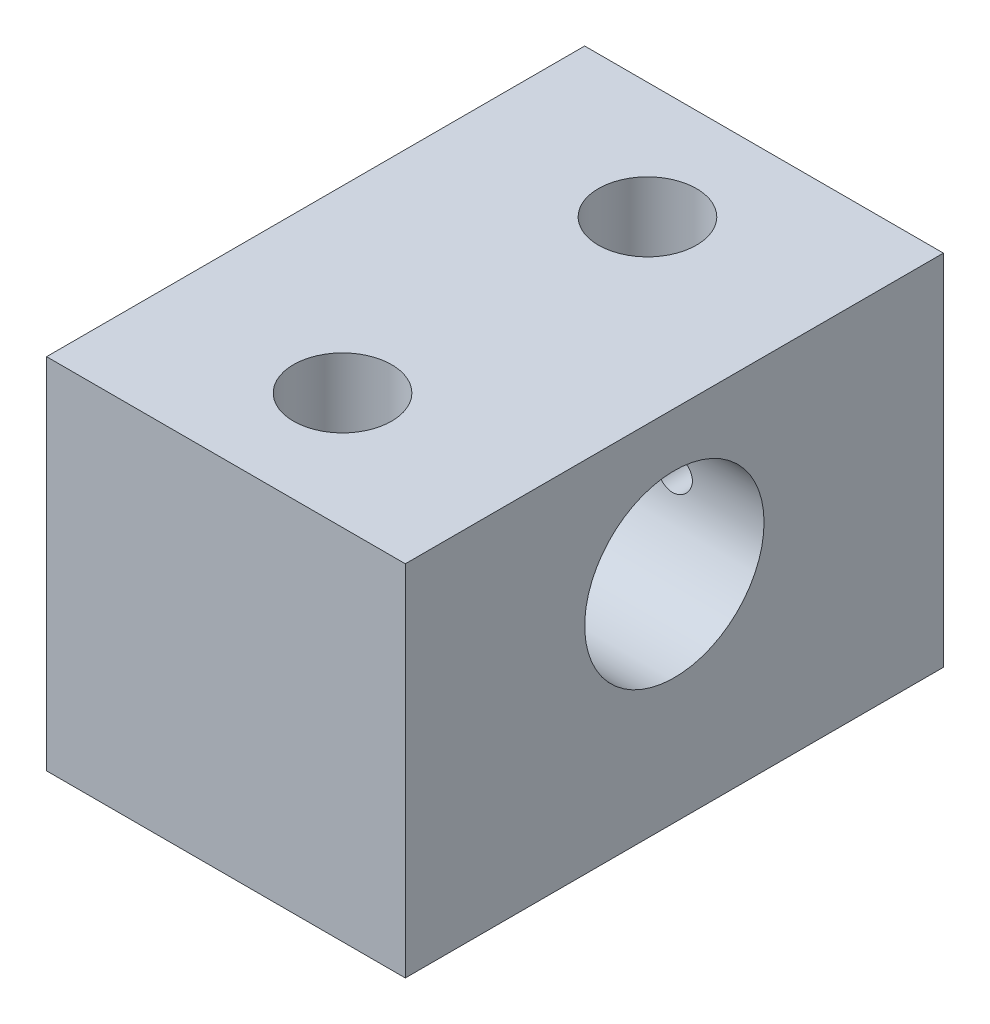
ISO-10303-21;
HEADER;
FILE_DESCRIPTION(('STEP AP214'),'2;1');
FILE_NAME('part.step','',(''),(''),'','','');
FILE_SCHEMA(('AUTOMOTIVE_DESIGN { 1 0 10303 214 1 1 1 1 }'));
ENDSEC;
DATA;
#1=APPLICATION_CONTEXT('core data for automotive mechanical design processes');
#2=APPLICATION_PROTOCOL_DEFINITION('international standard','automotive_design',2000,#1);
#3=PRODUCT_CONTEXT('',#1,'mechanical');
#4=PRODUCT('Part','Part','',(#3));
#5=PRODUCT_RELATED_PRODUCT_CATEGORY('part','',(#4));
#6=PRODUCT_DEFINITION_FORMATION('','',#4);
#7=PRODUCT_DEFINITION_CONTEXT('part definition',#1,'design');
#8=PRODUCT_DEFINITION('design','',#6,#7);
#9=PRODUCT_DEFINITION_SHAPE('','',#8);
#10=(LENGTH_UNIT() NAMED_UNIT(*) SI_UNIT(.MILLI.,.METRE.));
#11=(NAMED_UNIT(*) PLANE_ANGLE_UNIT() SI_UNIT($,.RADIAN.));
#12=(NAMED_UNIT(*) SI_UNIT($,.STERADIAN.) SOLID_ANGLE_UNIT());
#13=UNCERTAINTY_MEASURE_WITH_UNIT(LENGTH_MEASURE(1.E-05),#10,'distance_accuracy_value','');
#14=(GEOMETRIC_REPRESENTATION_CONTEXT(3) GLOBAL_UNCERTAINTY_ASSIGNED_CONTEXT((#13)) GLOBAL_UNIT_ASSIGNED_CONTEXT((#10,
#11,#12)) REPRESENTATION_CONTEXT('',''));
#15=CARTESIAN_POINT('',(0.,0.,0.));
#16=DIRECTION('',(0.,0.,1.));
#17=DIRECTION('',(1.,0.,0.));
#18=AXIS2_PLACEMENT_3D('',#15,#16,#17);
#19=CARTESIAN_POINT('',(25.4,-25.4,38.1));
#20=DIRECTION('',(-1.,0.,0.));
#21=DIRECTION('',(0.,0.,1.));
#22=AXIS2_PLACEMENT_3D('',#19,#20,#21);
#23=PLANE('',#22);
#24=CARTESIAN_POINT('',(25.4,5.08,0.));
#25=DIRECTION('',(1.,0.,0.));
#26=DIRECTION('',(0.,0.,-1.));
#27=AXIS2_PLACEMENT_3D('',#24,#25,#26);
#28=CIRCLE('',#27,12.7);
#29=CARTESIAN_POINT('',(25.4,5.08,-12.7));
#30=VERTEX_POINT('',#29);
#31=EDGE_CURVE('E118',#30,#30,#28,.T.);
#32=ORIENTED_EDGE('',*,*,#31,.F.);
#33=EDGE_LOOP('',(#32));
#34=FACE_BOUND('',#33,.T.);
#35=DIRECTION('',(0.,1.,0.));
#36=VECTOR('',#35,1.);
#37=CARTESIAN_POINT('',(25.4,-25.4,-38.1));
#38=LINE('',#37,#36);
#39=CARTESIAN_POINT('',(25.4,-25.4,-38.1));
#40=VERTEX_POINT('',#39);
#41=CARTESIAN_POINT('',(25.4,25.4,-38.1));
#42=VERTEX_POINT('',#41);
#43=EDGE_CURVE('E104',#40,#42,#38,.T.);
#44=ORIENTED_EDGE('',*,*,#43,.T.);
#45=DIRECTION('',(0.,0.,-1.));
#46=VECTOR('',#45,1.);
#47=CARTESIAN_POINT('',(25.4,25.4,38.1));
#48=LINE('',#47,#46);
#49=CARTESIAN_POINT('',(25.4,25.4,38.1));
#50=VERTEX_POINT('',#49);
#51=EDGE_CURVE('E11',#50,#42,#48,.T.);
#52=ORIENTED_EDGE('',*,*,#51,.F.);
#53=DIRECTION('',(0.,1.,0.));
#54=VECTOR('',#53,1.);
#55=CARTESIAN_POINT('',(25.4,-25.4,38.1));
#56=LINE('',#55,#54);
#57=CARTESIAN_POINT('',(25.4,-25.4,38.1));
#58=VERTEX_POINT('',#57);
#59=EDGE_CURVE('E92',#58,#50,#56,.T.);
#60=ORIENTED_EDGE('',*,*,#59,.F.);
#61=DIRECTION('',(0.,0.,-1.));
#62=VECTOR('',#61,1.);
#63=CARTESIAN_POINT('',(25.4,-25.4,38.1));
#64=LINE('',#63,#62);
#65=EDGE_CURVE('E100',#58,#40,#64,.T.);
#66=ORIENTED_EDGE('',*,*,#65,.T.);
#67=EDGE_LOOP('',(#44,#52,#60,#66));
#68=FACE_BOUND('',#67,.T.);
#69=ADVANCED_FACE('F40',(#34,#68),#23,.F.);
#70=CARTESIAN_POINT('',(-25.4,25.4,38.1));
#71=DIRECTION('',(0.,-1.,0.));
#72=DIRECTION('',(0.,0.,-1.));
#73=AXIS2_PLACEMENT_3D('',#70,#71,#72);
#74=PLANE('',#73);
#75=CARTESIAN_POINT('',(0.,25.4,-21.59));
#76=DIRECTION('',(0.,1.,0.));
#77=DIRECTION('',(0.,0.,1.));
#78=AXIS2_PLACEMENT_3D('',#75,#76,#77);
#79=CIRCLE('',#78,6.94562999999999);
#80=CARTESIAN_POINT('',(0.,25.4,-14.64437));
#81=VERTEX_POINT('',#80);
#82=EDGE_CURVE('E132',#81,#81,#79,.T.);
#83=ORIENTED_EDGE('',*,*,#82,.F.);
#84=EDGE_LOOP('',(#83));
#85=FACE_BOUND('',#84,.T.);
#86=CARTESIAN_POINT('',(0.,25.4,21.59));
#87=DIRECTION('',(0.,1.,0.));
#88=DIRECTION('',(0.,0.,1.));
#89=AXIS2_PLACEMENT_3D('',#86,#87,#88);
#90=CIRCLE('',#89,6.94562999999999);
#91=CARTESIAN_POINT('',(0.,25.4,28.53563));
#92=VERTEX_POINT('',#91);
#93=EDGE_CURVE('E126',#92,#92,#90,.T.);
#94=ORIENTED_EDGE('',*,*,#93,.F.);
#95=EDGE_LOOP('',(#94));
#96=FACE_BOUND('',#95,.T.);
#97=DIRECTION('',(-1.,0.,0.));
#98=VECTOR('',#97,1.);
#99=CARTESIAN_POINT('',(-25.4,25.4,-38.1));
#100=LINE('',#99,#98);
#101=CARTESIAN_POINT('',(-25.4,25.4,-38.1));
#102=VERTEX_POINT('',#101);
#103=EDGE_CURVE('E96',#42,#102,#100,.T.);
#104=ORIENTED_EDGE('',*,*,#103,.T.);
#105=DIRECTION('',(0.,0.,-1.));
#106=VECTOR('',#105,1.);
#107=CARTESIAN_POINT('',(-25.4,25.4,38.1));
#108=LINE('',#107,#106);
#109=CARTESIAN_POINT('',(-25.4,25.4,38.1));
#110=VERTEX_POINT('',#109);
#111=EDGE_CURVE('E49',#110,#102,#108,.T.);
#112=ORIENTED_EDGE('',*,*,#111,.F.);
#113=DIRECTION('',(-1.,0.,0.));
#114=VECTOR('',#113,1.);
#115=CARTESIAN_POINT('',(-25.4,25.4,38.1));
#116=LINE('',#115,#114);
#117=EDGE_CURVE('E87',#50,#110,#116,.T.);
#118=ORIENTED_EDGE('',*,*,#117,.F.);
#119=ORIENTED_EDGE('',*,*,#51,.T.);
#120=EDGE_LOOP('',(#104,#112,#118,#119));
#121=FACE_BOUND('',#120,.T.);
#122=ADVANCED_FACE('F95',(#85,#96,#121),#74,.F.);
#123=CARTESIAN_POINT('',(-25.4,-25.4,38.1));
#124=DIRECTION('',(1.,0.,0.));
#125=DIRECTION('',(0.,0.,-1.));
#126=AXIS2_PLACEMENT_3D('',#123,#124,#125);
#127=PLANE('',#126);
#128=CARTESIAN_POINT('',(-25.4,5.08,0.));
#129=DIRECTION('',(1.,0.,0.));
#130=DIRECTION('',(0.,0.,-1.));
#131=AXIS2_PLACEMENT_3D('',#128,#129,#130);
#132=CIRCLE('',#131,12.7);
#133=CARTESIAN_POINT('',(-25.4,5.08,-12.7));
#134=VERTEX_POINT('',#133);
#135=EDGE_CURVE('E107',#134,#134,#132,.T.);
#136=ORIENTED_EDGE('',*,*,#135,.T.);
#137=EDGE_LOOP('',(#136));
#138=FACE_BOUND('',#137,.T.);
#139=DIRECTION('',(0.,-1.,0.));
#140=VECTOR('',#139,1.);
#141=CARTESIAN_POINT('',(-25.4,-25.4,-38.1));
#142=LINE('',#141,#140);
#143=CARTESIAN_POINT('',(-25.4,-25.4,-38.1));
#144=VERTEX_POINT('',#143);
#145=EDGE_CURVE('E74',#102,#144,#142,.T.);
#146=ORIENTED_EDGE('',*,*,#145,.T.);
#147=DIRECTION('',(0.,0.,-1.));
#148=VECTOR('',#147,1.);
#149=CARTESIAN_POINT('',(-25.4,-25.4,38.1));
#150=LINE('',#149,#148);
#151=CARTESIAN_POINT('',(-25.4,-25.4,38.1));
#152=VERTEX_POINT('',#151);
#153=EDGE_CURVE('E97',#152,#144,#150,.T.);
#154=ORIENTED_EDGE('',*,*,#153,.F.);
#155=DIRECTION('',(0.,-1.,0.));
#156=VECTOR('',#155,1.);
#157=CARTESIAN_POINT('',(-25.4,-25.4,38.1));
#158=LINE('',#157,#156);
#159=EDGE_CURVE('E90',#110,#152,#158,.T.);
#160=ORIENTED_EDGE('',*,*,#159,.F.);
#161=ORIENTED_EDGE('',*,*,#111,.T.);
#162=EDGE_LOOP('',(#146,#154,#160,#161));
#163=FACE_BOUND('',#162,.T.);
#164=ADVANCED_FACE('F98',(#138,#163),#127,.F.);
#165=CARTESIAN_POINT('',(-25.4,-25.4,38.1));
#166=DIRECTION('',(0.,1.,0.));
#167=DIRECTION('',(0.,0.,1.));
#168=AXIS2_PLACEMENT_3D('',#165,#166,#167);
#169=PLANE('',#168);
#170=CARTESIAN_POINT('',(0.,-25.4,-21.59));
#171=DIRECTION('',(0.,1.,0.));
#172=DIRECTION('',(0.,0.,1.));
#173=AXIS2_PLACEMENT_3D('',#170,#171,#172);
#174=CIRCLE('',#173,6.94562999999999);
#175=CARTESIAN_POINT('',(0.,-25.4,-14.64437));
#176=VERTEX_POINT('',#175);
#177=EDGE_CURVE('E129',#176,#176,#174,.T.);
#178=ORIENTED_EDGE('',*,*,#177,.T.);
#179=EDGE_LOOP('',(#178));
#180=FACE_BOUND('',#179,.T.);
#181=CARTESIAN_POINT('',(0.,-25.4,21.59));
#182=DIRECTION('',(0.,1.,0.));
#183=DIRECTION('',(0.,0.,1.));
#184=AXIS2_PLACEMENT_3D('',#181,#182,#183);
#185=CIRCLE('',#184,6.94562999999999);
#186=CARTESIAN_POINT('',(0.,-25.4,28.53563));
#187=VERTEX_POINT('',#186);
#188=EDGE_CURVE('E121',#187,#187,#185,.T.);
#189=ORIENTED_EDGE('',*,*,#188,.T.);
#190=EDGE_LOOP('',(#189));
#191=FACE_BOUND('',#190,.T.);
#192=DIRECTION('',(1.,0.,0.));
#193=VECTOR('',#192,1.);
#194=CARTESIAN_POINT('',(-25.4,-25.4,-38.1));
#195=LINE('',#194,#193);
#196=EDGE_CURVE('E80',#144,#40,#195,.T.);
#197=ORIENTED_EDGE('',*,*,#196,.T.);
#198=ORIENTED_EDGE('',*,*,#65,.F.);
#199=DIRECTION('',(1.,0.,0.));
#200=VECTOR('',#199,1.);
#201=CARTESIAN_POINT('',(-25.4,-25.4,38.1));
#202=LINE('',#201,#200);
#203=EDGE_CURVE('E57',#152,#58,#202,.T.);
#204=ORIENTED_EDGE('',*,*,#203,.F.);
#205=ORIENTED_EDGE('',*,*,#153,.T.);
#206=EDGE_LOOP('',(#197,#198,#204,#205));
#207=FACE_BOUND('',#206,.T.);
#208=ADVANCED_FACE('F112',(#180,#191,#207),#169,.F.);
#209=CARTESIAN_POINT('',(25.4,25.4,38.1));
#210=DIRECTION('',(0.,0.,-1.));
#211=DIRECTION('',(-1.,0.,0.));
#212=AXIS2_PLACEMENT_3D('',#209,#210,#211);
#213=PLANE('',#212);
#214=ORIENTED_EDGE('',*,*,#59,.T.);
#215=ORIENTED_EDGE('',*,*,#117,.T.);
#216=ORIENTED_EDGE('',*,*,#159,.T.);
#217=ORIENTED_EDGE('',*,*,#203,.T.);
#218=EDGE_LOOP('',(#214,#215,#216,#217));
#219=FACE_BOUND('',#218,.T.);
#220=ADVANCED_FACE('F88',(#219),#213,.F.);
#221=CARTESIAN_POINT('',(25.4,25.4,-38.1));
#222=DIRECTION('',(0.,0.,-1.));
#223=DIRECTION('',(-1.,0.,0.));
#224=AXIS2_PLACEMENT_3D('',#221,#222,#223);
#225=PLANE('',#224);
#226=CARTESIAN_POINT('',(-12.7,5.08,-38.1));
#227=DIRECTION('',(0.,0.,-1.));
#228=DIRECTION('',(-1.,0.,0.));
#229=AXIS2_PLACEMENT_3D('',#226,#227,#228);
#230=CIRCLE('',#229,2.55269999999999);
#231=CARTESIAN_POINT('',(-15.2527,5.08,-38.1));
#232=VERTEX_POINT('',#231);
#233=EDGE_CURVE('E161',#232,#232,#230,.T.);
#234=ORIENTED_EDGE('',*,*,#233,.F.);
#235=EDGE_LOOP('',(#234));
#236=FACE_BOUND('',#235,.T.);
#237=CARTESIAN_POINT('',(12.7,5.08,-38.1));
#238=DIRECTION('',(0.,0.,-1.));
#239=DIRECTION('',(-1.,0.,0.));
#240=AXIS2_PLACEMENT_3D('',#237,#238,#239);
#241=CIRCLE('',#240,2.55269999999999);
#242=CARTESIAN_POINT('',(10.1473,5.08,-38.1));
#243=VERTEX_POINT('',#242);
#244=EDGE_CURVE('E142',#243,#243,#241,.T.);
#245=ORIENTED_EDGE('',*,*,#244,.F.);
#246=EDGE_LOOP('',(#245));
#247=FACE_BOUND('',#246,.T.);
#248=ORIENTED_EDGE('',*,*,#43,.F.);
#249=ORIENTED_EDGE('',*,*,#196,.F.);
#250=ORIENTED_EDGE('',*,*,#145,.F.);
#251=ORIENTED_EDGE('',*,*,#103,.F.);
#252=EDGE_LOOP('',(#248,#249,#250,#251));
#253=FACE_BOUND('',#252,.T.);
#254=ADVANCED_FACE('F115',(#236,#247,#253),#225,.T.);
#255=CARTESIAN_POINT('',(-25.4,5.08,0.));
#256=DIRECTION('',(1.,0.,0.));
#257=DIRECTION('',(0.,0.,-1.));
#258=AXIS2_PLACEMENT_3D('',#255,#256,#257);
#259=CYLINDRICAL_SURFACE('',#258,12.7);
#260=CARTESIAN_POINT('',(-15.2527,5.08,-12.7));
#261=CARTESIAN_POINT('',(-15.2526947992652,5.22185621055683,-12.6999973836125));
#262=CARTESIAN_POINT('',(-15.2408354019713,5.363778014555,-12.6975988645737));
#263=CARTESIAN_POINT('',(-15.1937494200947,5.64360906921233,-12.6882620663431));
#264=CARTESIAN_POINT('',(-15.1585043671802,5.78151505854008,-12.6813201991963));
#265=CARTESIAN_POINT('',(-15.0657806634625,6.04922822766643,-12.6636717493926));
#266=CARTESIAN_POINT('',(-15.0083234083448,6.17904306188462,-12.6529687904705));
#267=CARTESIAN_POINT('',(-14.8728701068456,6.42718134295211,-12.6289612418531));
#268=CARTESIAN_POINT('',(-14.7948752477406,6.54550545353773,-12.6156568025605));
#269=CARTESIAN_POINT('',(-14.6194303316011,6.76892996901581,-12.5877068517561));
#270=CARTESIAN_POINT('',(-14.5217536744985,6.87385064772143,-12.5730469098802));
#271=CARTESIAN_POINT('',(-14.3102049245976,7.06593364961852,-12.5441430340592));
#272=CARTESIAN_POINT('',(-14.1963315593889,7.15309457629733,-12.5298991329043));
#273=CARTESIAN_POINT('',(-13.9543272075157,7.30795031612871,-12.503299099816));
#274=CARTESIAN_POINT('',(-13.8260747465399,7.37545876345371,-12.4909615307886));
#275=CARTESIAN_POINT('',(-13.5597582831116,7.48789922201016,-12.4697761123132));
#276=CARTESIAN_POINT('',(-13.4216952618011,7.53283348724065,-12.4609279144755));
#277=CARTESIAN_POINT('',(-13.1416112808219,7.59826606184009,-12.4478691093208));
#278=CARTESIAN_POINT('',(-12.9996668685902,7.61907984994944,-12.4435986847958));
#279=CARTESIAN_POINT('',(-12.714241420859,7.63666060131799,-12.4399989112979));
#280=CARTESIAN_POINT('',(-12.5707605456212,7.63343004860282,-12.4406690519141));
#281=CARTESIAN_POINT('',(-12.2886450774652,7.60326882881563,-12.4468203533509));
#282=CARTESIAN_POINT('',(-12.1499699525371,7.57670006112812,-12.4522280468367));
#283=CARTESIAN_POINT('',(-11.87908634573,7.5011879537588,-12.4671294390268));
#284=CARTESIAN_POINT('',(-11.7468781758096,7.45224353587667,-12.4766233346287));
#285=CARTESIAN_POINT('',(-11.4916397460598,7.33302460013361,-12.4987023805749));
#286=CARTESIAN_POINT('',(-11.3686782438108,7.26260685945089,-12.5113081757149));
#287=CARTESIAN_POINT('',(-11.1361812029433,7.10254121619102,-12.538177441116));
#288=CARTESIAN_POINT('',(-11.0266472244626,7.01289108233261,-12.5524411036294));
#289=CARTESIAN_POINT('',(-10.8220264962329,6.81496896015372,-12.5813370668157));
#290=CARTESIAN_POINT('',(-10.7272384840096,6.70638815322406,-12.5959713559519));
#291=CARTESIAN_POINT('',(-10.5571741129816,6.47471255482944,-12.6237223479193));
#292=CARTESIAN_POINT('',(-10.4818980092457,6.35161757365896,-12.6368390309105));
#293=CARTESIAN_POINT('',(-10.3529380554906,6.09407432274509,-12.6601096493237));
#294=CARTESIAN_POINT('',(-10.2992886112446,5.95960837082679,-12.6702588568104));
#295=CARTESIAN_POINT('',(-10.2154247810303,5.68332248455413,-12.6864151381535));
#296=CARTESIAN_POINT('',(-10.1852075272174,5.54150345240397,-12.6924227188899));
#297=CARTESIAN_POINT('',(-10.1494893705948,5.25710405149839,-12.6995481841004));
#298=CARTESIAN_POINT('',(-10.1435796797751,5.11457698677809,-12.7007469316581));
#299=CARTESIAN_POINT('',(-10.1555431228646,4.83057195391276,-12.6983443714293));
#300=CARTESIAN_POINT('',(-10.173414905817,4.68909392663404,-12.6947433363045));
#301=CARTESIAN_POINT('',(-10.2320943965551,4.41252361650848,-12.6831964518339));
#302=CARTESIAN_POINT('',(-10.2726921154069,4.27738497326151,-12.6752903990727));
#303=CARTESIAN_POINT('',(-10.3754414059752,4.01583326927467,-12.6560168288592));
#304=CARTESIAN_POINT('',(-10.4375946045411,3.88942086799122,-12.644649050149));
#305=CARTESIAN_POINT('',(-10.5825732272068,3.64718774800871,-12.6195117376563));
#306=CARTESIAN_POINT('',(-10.6656444578398,3.53151710608073,-12.6057142777796));
#307=CARTESIAN_POINT('',(-10.8497722092937,3.3156108029819,-12.5773133106478));
#308=CARTESIAN_POINT('',(-10.9508306791088,3.2153768166362,-12.562709716163));
#309=CARTESIAN_POINT('',(-11.1699259572378,3.03160941049292,-12.5340694771794));
#310=CARTESIAN_POINT('',(-11.2882001282524,2.94835675587258,-12.5200450170782));
#311=CARTESIAN_POINT('',(-11.5372939688025,2.80289869313083,-12.494410233843));
#312=CARTESIAN_POINT('',(-11.6681131335114,2.74069243853096,-12.4827998136245));
#313=CARTESIAN_POINT('',(-11.9379217015593,2.63947505848073,-12.4634063332917));
#314=CARTESIAN_POINT('',(-12.0768642572503,2.60034305124752,-12.4556033644444));
#315=CARTESIAN_POINT('',(-12.3595263031243,2.54601894731612,-12.4446663941807));
#316=CARTESIAN_POINT('',(-12.5032451607552,2.53082369334012,-12.4415317770077));
#317=CARTESIAN_POINT('',(-12.7885606359953,2.52492219651597,-12.4403208492062));
#318=CARTESIAN_POINT('',(-12.9301478725412,2.53377222282896,-12.4421528827854));
#319=CARTESIAN_POINT('',(-13.2097712280986,2.57473008989781,-12.4504639175017));
#320=CARTESIAN_POINT('',(-13.3478073762625,2.60683773965789,-12.4569428804773));
#321=CARTESIAN_POINT('',(-13.6161242795811,2.69320063091545,-12.4737765848225));
#322=CARTESIAN_POINT('',(-13.7464233598288,2.74740093597113,-12.4841217071844));
#323=CARTESIAN_POINT('',(-13.9961477072286,2.8763594366996,-12.5075274993734));
#324=CARTESIAN_POINT('',(-14.1155720497917,2.95111937821997,-12.5205883997912));
#325=CARTESIAN_POINT('',(-14.342365302721,3.12058830163532,-12.5482342158997));
#326=CARTESIAN_POINT('',(-14.4494922447589,3.21561752031027,-12.5628414330946));
#327=CARTESIAN_POINT('',(-14.6464259525452,3.42226694502354,-12.5917744882506));
#328=CARTESIAN_POINT('',(-14.7362287317801,3.53389095930028,-12.6061002607682));
#329=CARTESIAN_POINT('',(-14.8968635898942,3.77198204587299,-12.6330352312072));
#330=CARTESIAN_POINT('',(-14.9674847101187,3.8985937803947,-12.6456246451832));
#331=CARTESIAN_POINT('',(-15.0863360028624,4.16210586346436,-12.6674735086059));
#332=CARTESIAN_POINT('',(-15.1345862859573,4.29899684218134,-12.676735947189));
#333=CARTESIAN_POINT('',(-15.1980196258905,4.54348904901051,-12.6890953080047));
#334=CARTESIAN_POINT('',(-15.218488077794,4.64970181197705,-12.6931605653143));
#335=CARTESIAN_POINT('',(-15.2458300250375,4.86393040309643,-12.6986138643494));
#336=CARTESIAN_POINT('',(-15.2527039614712,4.97194617263341,-12.7000019929384));
#337=CARTESIAN_POINT('',(-15.2527,5.08,-12.7));
#338=B_SPLINE_CURVE_WITH_KNOTS('',3,(#260,#261,#262,#263,#264,#265,#266,#267,#268,#269,#270,
#271,#272,#273,#274,#275,#276,#277,#278,#279,#280,#281,#282,#283,#284,#285,#286,#287,#288,#289,
#290,#291,#292,#293,#294,#295,#296,#297,#298,#299,#300,#301,#302,#303,#304,#305,#306,#307,#308,
#309,#310,#311,#312,#313,#314,#315,#316,#317,#318,#319,#320,#321,#322,#323,#324,#325,#326,#327,
#328,#329,#330,#331,#332,#333,#334,#335,#336,#337),.UNSPECIFIED.,.T.,.F.,(4,2,2,2,2,2,2,2,2,2,2,
2,2,2,2,2,2,2,2,2,2,2,2,2,2,2,2,2,2,2,2,2,2,2,2,2,2,2,4),(0.,0.425173326858356,
0.850682825726684,1.2757834739137,1.70085955247507,2.13114227989731,2.56145882893965,
2.99573225362803,3.42996230812811,3.85844645262253,4.28688633094916,4.70879751785864,
5.13072903726015,5.55553870266187,5.98039767981269,6.41297793207708,6.84556383894965,
7.27883525459764,7.71205363417527,8.13795588808109,8.56383394874412,8.98584032623792,
9.40787856061099,9.83512862114261,10.2624250042594,10.6962975397843,11.1301526230407,
11.5617141464937,11.9932187418526,12.416814710791,12.8404072011224,13.2629527342798,
13.6855341595118,14.1153652704348,14.5452951733749,14.9797777811893,15.4138690438583,
15.7377399254776,16.061600298463),.UNSPECIFIED.);
#339=CARTESIAN_POINT('',(-15.2527,5.08,-12.7));
#340=VERTEX_POINT('',#339);
#341=EDGE_CURVE('E156',#340,#340,#338,.T.);
#342=ORIENTED_EDGE('',*,*,#341,.T.);
#343=EDGE_LOOP('',(#342));
#344=FACE_BOUND('',#343,.T.);
#345=CARTESIAN_POINT('',(10.1473,5.08,-12.7));
#346=CARTESIAN_POINT('',(10.1473052007348,5.22185621055683,-12.6999973836125));
#347=CARTESIAN_POINT('',(10.1591645980288,5.363778014555,-12.6975988645737));
#348=CARTESIAN_POINT('',(10.2062505799054,5.64360906921233,-12.6882620663431));
#349=CARTESIAN_POINT('',(10.2414956328198,5.78151505854007,-12.6813201991963));
#350=CARTESIAN_POINT('',(10.3342193365375,6.04922822766643,-12.6636717493926));
#351=CARTESIAN_POINT('',(10.3916765916552,6.17904306188462,-12.6529687904705));
#352=CARTESIAN_POINT('',(10.5271298931544,6.42718134295211,-12.6289612418531));
#353=CARTESIAN_POINT('',(10.6051247522594,6.54550545353773,-12.6156568025605));
#354=CARTESIAN_POINT('',(10.7805696683989,6.76892996901581,-12.5877068517561));
#355=CARTESIAN_POINT('',(10.8782463255015,6.87385064772142,-12.5730469098802));
#356=CARTESIAN_POINT('',(11.0897950754024,7.06593364961852,-12.5441430340592));
#357=CARTESIAN_POINT('',(11.2036684406111,7.15309457629732,-12.5298991329043));
#358=CARTESIAN_POINT('',(11.4456727924844,7.3079503161287,-12.503299099816));
#359=CARTESIAN_POINT('',(11.5739252534601,7.3754587634537,-12.4909615307886));
#360=CARTESIAN_POINT('',(11.8402417168884,7.48789922201015,-12.4697761123132));
#361=CARTESIAN_POINT('',(11.9783047381989,7.53283348724065,-12.4609279144755));
#362=CARTESIAN_POINT('',(12.2583887191781,7.59826606184009,-12.4478691093208));
#363=CARTESIAN_POINT('',(12.4003331314099,7.61907984994944,-12.4435986847958));
#364=CARTESIAN_POINT('',(12.685758579141,7.63666060131799,-12.4399989112979));
#365=CARTESIAN_POINT('',(12.8292394543788,7.63343004860282,-12.4406690519141));
#366=CARTESIAN_POINT('',(13.1113549225348,7.60326882881562,-12.4468203533509));
#367=CARTESIAN_POINT('',(13.2500300474629,7.57670006112812,-12.4522280468367));
#368=CARTESIAN_POINT('',(13.52091365427,7.50118795375879,-12.4671294390268));
#369=CARTESIAN_POINT('',(13.6531218241904,7.45224353587667,-12.4766233346287));
#370=CARTESIAN_POINT('',(13.9083602539402,7.33302460013361,-12.4987023805749));
#371=CARTESIAN_POINT('',(14.0313217561892,7.26260685945089,-12.5113081757149));
#372=CARTESIAN_POINT('',(14.2638187970567,7.10254121619102,-12.538177441116));
#373=CARTESIAN_POINT('',(14.3733527755374,7.01289108233261,-12.5524411036294));
#374=CARTESIAN_POINT('',(14.5779735037671,6.81496896015372,-12.5813370668157));
#375=CARTESIAN_POINT('',(14.6727615159904,6.70638815322405,-12.5959713559519));
#376=CARTESIAN_POINT('',(14.8428258870184,6.47471255482944,-12.6237223479193));
#377=CARTESIAN_POINT('',(14.9181019907543,6.35161757365896,-12.6368390309105));
#378=CARTESIAN_POINT('',(15.0470619445094,6.09407432274509,-12.6601096493237));
#379=CARTESIAN_POINT('',(15.1007113887554,5.95960837082679,-12.6702588568104));
#380=CARTESIAN_POINT('',(15.1845752189698,5.68332248455413,-12.6864151381535));
#381=CARTESIAN_POINT('',(15.2147924727827,5.54150345240396,-12.6924227188899));
#382=CARTESIAN_POINT('',(15.2505106294052,5.25710405149839,-12.6995481841004));
#383=CARTESIAN_POINT('',(15.2564203202249,5.11457698677809,-12.7007469316581));
#384=CARTESIAN_POINT('',(15.2444568771354,4.83057195391276,-12.6983443714293));
#385=CARTESIAN_POINT('',(15.226585094183,4.68909392663404,-12.6947433363045));
#386=CARTESIAN_POINT('',(15.167905603445,4.41252361650848,-12.6831964518339));
#387=CARTESIAN_POINT('',(15.1273078845931,4.27738497326151,-12.6752903990727));
#388=CARTESIAN_POINT('',(15.0245585940248,4.01583326927467,-12.6560168288592));
#389=CARTESIAN_POINT('',(14.9624053954589,3.88942086799122,-12.644649050149));
#390=CARTESIAN_POINT('',(14.8174267727932,3.64718774800871,-12.6195117376563));
#391=CARTESIAN_POINT('',(14.7343555421602,3.53151710608073,-12.6057142777796));
#392=CARTESIAN_POINT('',(14.5502277907063,3.3156108029819,-12.5773133106478));
#393=CARTESIAN_POINT('',(14.4491693208912,3.21537681663621,-12.562709716163));
#394=CARTESIAN_POINT('',(14.2300740427622,3.03160941049292,-12.5340694771794));
#395=CARTESIAN_POINT('',(14.1117998717476,2.94835675587258,-12.5200450170782));
#396=CARTESIAN_POINT('',(13.8627060311975,2.80289869313083,-12.494410233843));
#397=CARTESIAN_POINT('',(13.7318868664886,2.74069243853097,-12.4827998136245));
#398=CARTESIAN_POINT('',(13.4620782984407,2.63947505848073,-12.4634063332917));
#399=CARTESIAN_POINT('',(13.3231357427497,2.60034305124753,-12.4556033644444));
#400=CARTESIAN_POINT('',(13.0404736968757,2.54601894731612,-12.4446663941807));
#401=CARTESIAN_POINT('',(12.8967548392448,2.53082369334013,-12.4415317770077));
#402=CARTESIAN_POINT('',(12.6114393640047,2.52492219651598,-12.4403208492063));
#403=CARTESIAN_POINT('',(12.4698521274588,2.53377222282896,-12.4421528827854));
#404=CARTESIAN_POINT('',(12.1902287719014,2.57473008989782,-12.4504639175017));
#405=CARTESIAN_POINT('',(12.0521926237375,2.6068377396579,-12.4569428804773));
#406=CARTESIAN_POINT('',(11.7838757204189,2.69320063091546,-12.4737765848225));
#407=CARTESIAN_POINT('',(11.6535766401712,2.74740093597113,-12.4841217071844));
#408=CARTESIAN_POINT('',(11.4038522927714,2.8763594366996,-12.5075274993734));
#409=CARTESIAN_POINT('',(11.2844279502083,2.95111937821997,-12.5205883997912));
#410=CARTESIAN_POINT('',(11.057634697279,3.12058830163532,-12.5482342158997));
#411=CARTESIAN_POINT('',(10.9505077552412,3.21561752031027,-12.5628414330946));
#412=CARTESIAN_POINT('',(10.7535740474548,3.42226694502355,-12.5917744882506));
#413=CARTESIAN_POINT('',(10.6637712682199,3.53389095930028,-12.6061002607682));
#414=CARTESIAN_POINT('',(10.5031364101058,3.77198204587299,-12.6330352312072));
#415=CARTESIAN_POINT('',(10.4325152898813,3.8985937803947,-12.6456246451832));
#416=CARTESIAN_POINT('',(10.3136639971376,4.16210586346436,-12.6674735086059));
#417=CARTESIAN_POINT('',(10.2654137140427,4.29899684218134,-12.676735947189));
#418=CARTESIAN_POINT('',(10.2019803741095,4.54348904901051,-12.6890953080047));
#419=CARTESIAN_POINT('',(10.181511922206,4.64970181197706,-12.6931605653143));
#420=CARTESIAN_POINT('',(10.1541699749625,4.86393040309643,-12.6986138643494));
#421=CARTESIAN_POINT('',(10.1472960385288,4.97194617263341,-12.7000019929384));
#422=CARTESIAN_POINT('',(10.1473,5.08,-12.7));
#423=B_SPLINE_CURVE_WITH_KNOTS('',3,(#345,#346,#347,#348,#349,#350,#351,#352,#353,#354,#355,
#356,#357,#358,#359,#360,#361,#362,#363,#364,#365,#366,#367,#368,#369,#370,#371,#372,#373,#374,
#375,#376,#377,#378,#379,#380,#381,#382,#383,#384,#385,#386,#387,#388,#389,#390,#391,#392,#393,
#394,#395,#396,#397,#398,#399,#400,#401,#402,#403,#404,#405,#406,#407,#408,#409,#410,#411,#412,
#413,#414,#415,#416,#417,#418,#419,#420,#421,#422),.UNSPECIFIED.,.T.,.F.,(4,2,2,2,2,2,2,2,2,2,2,
2,2,2,2,2,2,2,2,2,2,2,2,2,2,2,2,2,2,2,2,2,2,2,2,2,2,2,4),(0.,0.425173326858356,
0.850682825726683,1.2757834739137,1.70085955247507,2.13114227989731,2.56145882893965,
2.99573225362803,3.42996230812811,3.85844645262253,4.28688633094915,4.70879751785864,
5.13072903726014,5.55553870266186,5.98039767981268,6.41297793207708,6.84556383894964,
7.27883525459763,7.71205363417526,8.13795588808108,8.5638339487441,8.98584032623791,
9.40787856061098,9.8351286211426,10.2624250042594,10.6962975397843,11.1301526230407,
11.5617141464937,11.9932187418526,12.4168147107909,12.8404072011224,13.2629527342798,
13.6855341595118,14.1153652704348,14.5452951733749,14.9797777811893,15.4138690438583,
15.7377399254776,16.061600298463),.UNSPECIFIED.);
#424=CARTESIAN_POINT('',(10.1473,5.08,-12.7));
#425=VERTEX_POINT('',#424);
#426=EDGE_CURVE('E135',#425,#425,#423,.T.);
#427=ORIENTED_EDGE('',*,*,#426,.T.);
#428=EDGE_LOOP('',(#427));
#429=FACE_BOUND('',#428,.T.);
#430=ORIENTED_EDGE('',*,*,#135,.F.);
#431=EDGE_LOOP('',(#430));
#432=FACE_BOUND('',#431,.T.);
#433=ORIENTED_EDGE('',*,*,#31,.T.);
#434=EDGE_LOOP('',(#433));
#435=FACE_BOUND('',#434,.T.);
#436=ADVANCED_FACE('F168',(#344,#429,#432,#435),#259,.F.);
#437=CARTESIAN_POINT('',(0.,25.4,21.59));
#438=DIRECTION('',(0.,1.,0.));
#439=DIRECTION('',(0.,0.,1.));
#440=AXIS2_PLACEMENT_3D('',#437,#438,#439);
#441=CYLINDRICAL_SURFACE('',#440,6.94562999999999);
#442=ORIENTED_EDGE('',*,*,#188,.F.);
#443=EDGE_LOOP('',(#442));
#444=FACE_BOUND('',#443,.T.);
#445=ORIENTED_EDGE('',*,*,#93,.T.);
#446=EDGE_LOOP('',(#445));
#447=FACE_BOUND('',#446,.T.);
#448=ADVANCED_FACE('F177',(#444,#447),#441,.F.);
#449=CARTESIAN_POINT('',(0.,25.4,-21.59));
#450=DIRECTION('',(0.,1.,0.));
#451=DIRECTION('',(0.,0.,1.));
#452=AXIS2_PLACEMENT_3D('',#449,#450,#451);
#453=CYLINDRICAL_SURFACE('',#452,6.94562999999999);
#454=ORIENTED_EDGE('',*,*,#177,.F.);
#455=EDGE_LOOP('',(#454));
#456=FACE_BOUND('',#455,.T.);
#457=ORIENTED_EDGE('',*,*,#82,.T.);
#458=EDGE_LOOP('',(#457));
#459=FACE_BOUND('',#458,.T.);
#460=ADVANCED_FACE('F151',(#456,#459),#453,.F.);
#461=CARTESIAN_POINT('',(12.7,5.08,-38.1));
#462=DIRECTION('',(0.,0.,-1.));
#463=DIRECTION('',(-1.,0.,0.));
#464=AXIS2_PLACEMENT_3D('',#461,#462,#463);
#465=CYLINDRICAL_SURFACE('',#464,2.55269999999999);
#466=ORIENTED_EDGE('',*,*,#426,.F.);
#467=EDGE_LOOP('',(#466));
#468=FACE_BOUND('',#467,.T.);
#469=ORIENTED_EDGE('',*,*,#244,.T.);
#470=EDGE_LOOP('',(#469));
#471=FACE_BOUND('',#470,.T.);
#472=ADVANCED_FACE('F146',(#468,#471),#465,.F.);
#473=CARTESIAN_POINT('',(-12.7,5.08,-38.1));
#474=DIRECTION('',(0.,0.,-1.));
#475=DIRECTION('',(-1.,0.,0.));
#476=AXIS2_PLACEMENT_3D('',#473,#474,#475);
#477=CYLINDRICAL_SURFACE('',#476,2.55269999999999);
#478=ORIENTED_EDGE('',*,*,#341,.F.);
#479=EDGE_LOOP('',(#478));
#480=FACE_BOUND('',#479,.T.);
#481=ORIENTED_EDGE('',*,*,#233,.T.);
#482=EDGE_LOOP('',(#481));
#483=FACE_BOUND('',#482,.T.);
#484=ADVANCED_FACE('F150',(#480,#483),#477,.F.);
#485=CLOSED_SHELL('',(#69,#122,#164,#208,#220,#254,#436,#448,#460,#472,#484));
#486=MANIFOLD_SOLID_BREP('B2',#485);
#487=ADVANCED_BREP_SHAPE_REPRESENTATION('',(#18,#486),#14);
#488=SHAPE_DEFINITION_REPRESENTATION(#9,#487);
ENDSEC;
END-ISO-10303-21;
